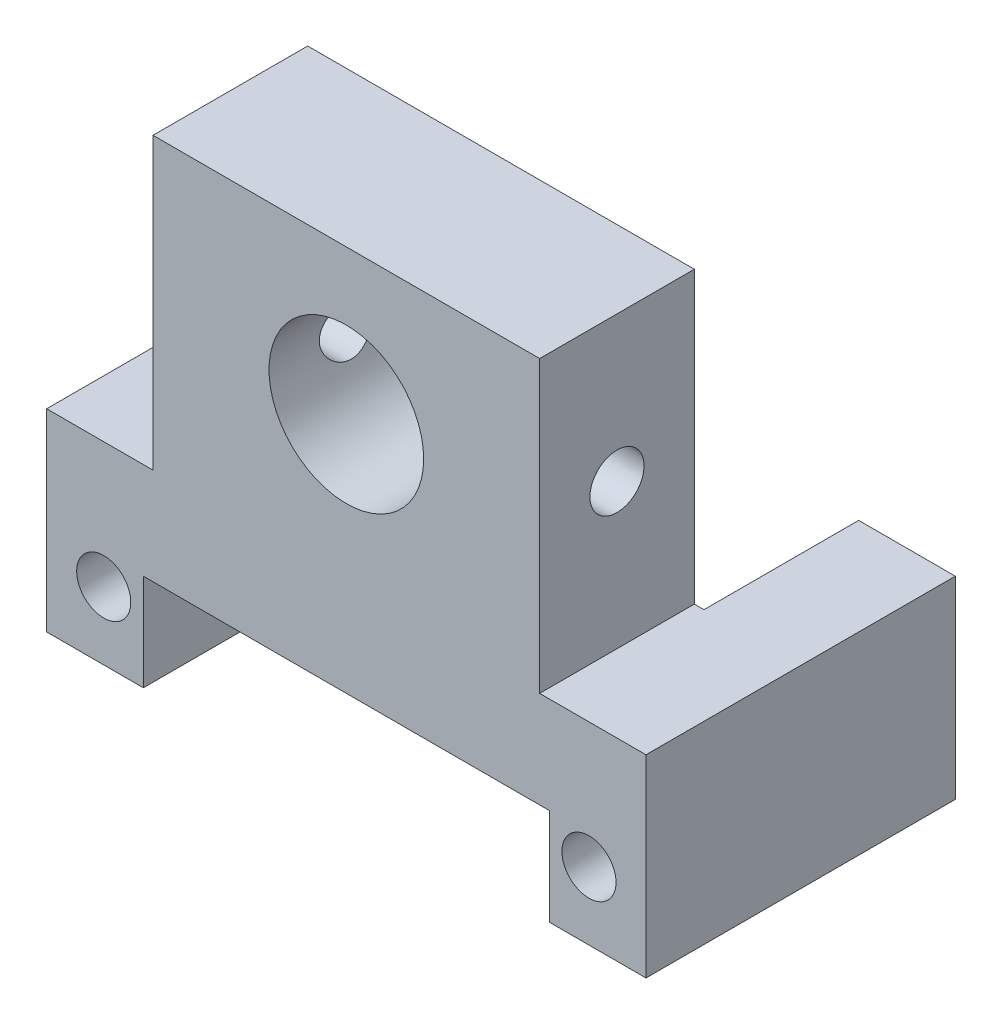
ISO-10303-21;
HEADER;
FILE_DESCRIPTION(('STEP AP214'),'2;1');
FILE_NAME('part.step','',(''),(''),'','','');
FILE_SCHEMA(('AUTOMOTIVE_DESIGN { 1 0 10303 214 1 1 1 1 }'));
ENDSEC;
DATA;
#1=APPLICATION_CONTEXT('core data for automotive mechanical design processes');
#2=APPLICATION_PROTOCOL_DEFINITION('international standard','automotive_design',2000,#1);
#3=PRODUCT_CONTEXT('',#1,'mechanical');
#4=PRODUCT('Part','Part','',(#3));
#5=PRODUCT_RELATED_PRODUCT_CATEGORY('part','',(#4));
#6=PRODUCT_DEFINITION_FORMATION('','',#4);
#7=PRODUCT_DEFINITION_CONTEXT('part definition',#1,'design');
#8=PRODUCT_DEFINITION('design','',#6,#7);
#9=PRODUCT_DEFINITION_SHAPE('','',#8);
#10=(LENGTH_UNIT() NAMED_UNIT(*) SI_UNIT(.MILLI.,.METRE.));
#11=(NAMED_UNIT(*) PLANE_ANGLE_UNIT() SI_UNIT($,.RADIAN.));
#12=(NAMED_UNIT(*) SI_UNIT($,.STERADIAN.) SOLID_ANGLE_UNIT());
#13=UNCERTAINTY_MEASURE_WITH_UNIT(LENGTH_MEASURE(1.E-05),#10,'distance_accuracy_value','');
#14=(GEOMETRIC_REPRESENTATION_CONTEXT(3) GLOBAL_UNCERTAINTY_ASSIGNED_CONTEXT((#13)) GLOBAL_UNIT_ASSIGNED_CONTEXT((#10,
#11,#12)) REPRESENTATION_CONTEXT('',''));
#15=CARTESIAN_POINT('',(0.,0.,0.));
#16=DIRECTION('',(0.,0.,1.));
#17=DIRECTION('',(1.,0.,0.));
#18=AXIS2_PLACEMENT_3D('',#15,#16,#17);
#19=CARTESIAN_POINT('',(0.,0.,0.));
#20=DIRECTION('',(0.,0.,-1.));
#21=DIRECTION('',(-1.,0.,0.));
#22=AXIS2_PLACEMENT_3D('',#19,#20,#21);
#23=PLANE('',#22);
#24=DIRECTION('',(-1.,0.,0.));
#25=VECTOR('',#24,1.);
#26=CARTESIAN_POINT('',(15.5,10.,0.));
#27=LINE('',#26,#25);
#28=CARTESIAN_POINT('',(-10.5,10.,0.));
#29=VERTEX_POINT('',#28);
#30=CARTESIAN_POINT('',(-15.5,10.,0.));
#31=VERTEX_POINT('',#30);
#32=EDGE_CURVE('E201',#29,#31,#27,.T.);
#33=ORIENTED_EDGE('',*,*,#32,.F.);
#34=DIRECTION('',(0.,1.,0.));
#35=VECTOR('',#34,1.);
#36=CARTESIAN_POINT('',(-10.5,0.,0.));
#37=LINE('',#36,#35);
#38=CARTESIAN_POINT('',(-10.5,0.,0.));
#39=VERTEX_POINT('',#38);
#40=EDGE_CURVE('E174',#39,#29,#37,.T.);
#41=ORIENTED_EDGE('',*,*,#40,.F.);
#42=DIRECTION('',(1.,0.,0.));
#43=VECTOR('',#42,1.);
#44=CARTESIAN_POINT('',(-10.5,0.,0.));
#45=LINE('',#44,#43);
#46=CARTESIAN_POINT('',(-15.5,0.,0.));
#47=VERTEX_POINT('',#46);
#48=EDGE_CURVE('E176',#47,#39,#45,.T.);
#49=ORIENTED_EDGE('',*,*,#48,.F.);
#50=DIRECTION('',(0.,-1.,0.));
#51=VECTOR('',#50,1.);
#52=CARTESIAN_POINT('',(-15.5,0.,0.));
#53=LINE('',#52,#51);
#54=EDGE_CURVE('E200',#31,#47,#53,.T.);
#55=ORIENTED_EDGE('',*,*,#54,.F.);
#56=EDGE_LOOP('',(#33,#41,#49,#55));
#57=FACE_BOUND('',#56,.T.);
#58=CARTESIAN_POINT('',(-12.55,3.5,0.));
#59=DIRECTION('',(0.,0.,1.));
#60=DIRECTION('',(-1.,0.,0.));
#61=AXIS2_PLACEMENT_3D('',#58,#59,#60);
#62=CIRCLE('',#61,1.4);
#63=CARTESIAN_POINT('',(-13.95,3.5,0.));
#64=VERTEX_POINT('',#63);
#65=EDGE_CURVE('E272',#64,#64,#62,.T.);
#66=ORIENTED_EDGE('',*,*,#65,.T.);
#67=EDGE_LOOP('',(#66));
#68=FACE_BOUND('',#67,.T.);
#69=ADVANCED_FACE('F33',(#57,#68),#23,.T.);
#70=CARTESIAN_POINT('',(15.5,10.,16.));
#71=DIRECTION('',(0.,-1.,0.));
#72=DIRECTION('',(0.,0.,-1.));
#73=AXIS2_PLACEMENT_3D('',#70,#71,#72);
#74=PLANE('',#73);
#75=DIRECTION('',(-1.,0.,0.));
#76=VECTOR('',#75,1.);
#77=CARTESIAN_POINT('',(15.5,10.,8.));
#78=LINE('',#77,#76);
#79=CARTESIAN_POINT('',(-10.,10.,8.));
#80=VERTEX_POINT('',#79);
#81=CARTESIAN_POINT('',(-10.5,10.,8.));
#82=VERTEX_POINT('',#81);
#83=EDGE_CURVE('E310',#80,#82,#78,.T.);
#84=ORIENTED_EDGE('',*,*,#83,.T.);
#85=DIRECTION('',(0.,0.,-1.));
#86=VECTOR('',#85,1.);
#87=CARTESIAN_POINT('',(-10.5,10.,16.));
#88=LINE('',#87,#86);
#89=EDGE_CURVE('E315',#82,#29,#88,.T.);
#90=ORIENTED_EDGE('',*,*,#89,.T.);
#91=ORIENTED_EDGE('',*,*,#32,.T.);
#92=DIRECTION('',(0.,0.,-1.));
#93=VECTOR('',#92,1.);
#94=CARTESIAN_POINT('',(-15.5,10.,16.));
#95=LINE('',#94,#93);
#96=CARTESIAN_POINT('',(-15.5,10.,16.));
#97=VERTEX_POINT('',#96);
#98=EDGE_CURVE('E357',#97,#31,#95,.T.);
#99=ORIENTED_EDGE('',*,*,#98,.F.);
#100=DIRECTION('',(-1.,0.,0.));
#101=VECTOR('',#100,1.);
#102=CARTESIAN_POINT('',(15.5,10.,16.));
#103=LINE('',#102,#101);
#104=CARTESIAN_POINT('',(-10.,10.,16.));
#105=VERTEX_POINT('',#104);
#106=EDGE_CURVE('E185',#105,#97,#103,.T.);
#107=ORIENTED_EDGE('',*,*,#106,.F.);
#108=DIRECTION('',(0.,0.,1.));
#109=VECTOR('',#108,1.);
#110=CARTESIAN_POINT('',(-10.,10.,16.));
#111=LINE('',#110,#109);
#112=EDGE_CURVE('E61',#80,#105,#111,.T.);
#113=ORIENTED_EDGE('',*,*,#112,.F.);
#114=EDGE_LOOP('',(#84,#90,#91,#99,#107,#113));
#115=FACE_BOUND('',#114,.T.);
#116=ADVANCED_FACE('F240',(#115),#74,.F.);
#117=DIRECTION('',(0.,0.,1.));
#118=VECTOR('',#117,1.);
#119=CARTESIAN_POINT('',(10.5,10.,16.));
#120=LINE('',#119,#118);
#121=CARTESIAN_POINT('',(10.5,10.,0.));
#122=VERTEX_POINT('',#121);
#123=CARTESIAN_POINT('',(10.5,10.,8.));
#124=VERTEX_POINT('',#123);
#125=EDGE_CURVE('E313',#122,#124,#120,.T.);
#126=ORIENTED_EDGE('',*,*,#125,.T.);
#127=DIRECTION('',(-1.,0.,0.));
#128=VECTOR('',#127,1.);
#129=CARTESIAN_POINT('',(15.5,10.,8.));
#130=LINE('',#129,#128);
#131=CARTESIAN_POINT('',(10.,10.,8.));
#132=VERTEX_POINT('',#131);
#133=EDGE_CURVE('E147',#124,#132,#130,.T.);
#134=ORIENTED_EDGE('',*,*,#133,.T.);
#135=DIRECTION('',(0.,0.,-1.));
#136=VECTOR('',#135,1.);
#137=CARTESIAN_POINT('',(10.,10.,16.));
#138=LINE('',#137,#136);
#139=CARTESIAN_POINT('',(10.,10.,16.));
#140=VERTEX_POINT('',#139);
#141=EDGE_CURVE('E283',#140,#132,#138,.T.);
#142=ORIENTED_EDGE('',*,*,#141,.F.);
#143=CARTESIAN_POINT('',(15.5,10.,16.));
#144=VERTEX_POINT('',#143);
#145=EDGE_CURVE('E194',#144,#140,#103,.T.);
#146=ORIENTED_EDGE('',*,*,#145,.F.);
#147=DIRECTION('',(0.,0.,-1.));
#148=VECTOR('',#147,1.);
#149=CARTESIAN_POINT('',(15.5,10.,16.));
#150=LINE('',#149,#148);
#151=CARTESIAN_POINT('',(15.5,10.,0.));
#152=VERTEX_POINT('',#151);
#153=EDGE_CURVE('E368',#144,#152,#150,.T.);
#154=ORIENTED_EDGE('',*,*,#153,.T.);
#155=EDGE_CURVE('E197',#152,#122,#27,.T.);
#156=ORIENTED_EDGE('',*,*,#155,.T.);
#157=EDGE_LOOP('',(#126,#134,#142,#146,#154,#156));
#158=FACE_BOUND('',#157,.T.);
#159=ADVANCED_FACE('F247',(#158),#74,.F.);
#160=CARTESIAN_POINT('',(0.,0.,16.));
#161=DIRECTION('',(0.,0.,-1.));
#162=DIRECTION('',(-1.,0.,0.));
#163=AXIS2_PLACEMENT_3D('',#160,#161,#162);
#164=PLANE('',#163);
#165=CARTESIAN_POINT('',(0.,17.5,16.));
#166=DIRECTION('',(0.,0.,1.));
#167=DIRECTION('',(1.,0.,0.));
#168=AXIS2_PLACEMENT_3D('',#165,#166,#167);
#169=CIRCLE('',#168,4.);
#170=CARTESIAN_POINT('',(4.,17.5,16.));
#171=VERTEX_POINT('',#170);
#172=EDGE_CURVE('E318',#171,#171,#169,.T.);
#173=ORIENTED_EDGE('',*,*,#172,.F.);
#174=EDGE_LOOP('',(#173));
#175=FACE_BOUND('',#174,.T.);
#176=CARTESIAN_POINT('',(12.55,3.5,16.));
#177=DIRECTION('',(0.,0.,1.));
#178=DIRECTION('',(1.,0.,0.));
#179=AXIS2_PLACEMENT_3D('',#176,#177,#178);
#180=CIRCLE('',#179,1.4);
#181=CARTESIAN_POINT('',(13.95,3.5,16.));
#182=VERTEX_POINT('',#181);
#183=EDGE_CURVE('E268',#182,#182,#180,.T.);
#184=ORIENTED_EDGE('',*,*,#183,.F.);
#185=EDGE_LOOP('',(#184));
#186=FACE_BOUND('',#185,.T.);
#187=DIRECTION('',(1.,0.,0.));
#188=VECTOR('',#187,1.);
#189=CARTESIAN_POINT('',(10.5,5.,16.));
#190=LINE('',#189,#188);
#191=CARTESIAN_POINT('',(-10.5,5.,16.));
#192=VERTEX_POINT('',#191);
#193=CARTESIAN_POINT('',(10.5,5.,16.));
#194=VERTEX_POINT('',#193);
#195=EDGE_CURVE('E168',#192,#194,#190,.T.);
#196=ORIENTED_EDGE('',*,*,#195,.T.);
#197=DIRECTION('',(0.,-1.,0.));
#198=VECTOR('',#197,1.);
#199=CARTESIAN_POINT('',(10.5,0.,16.));
#200=LINE('',#199,#198);
#201=CARTESIAN_POINT('',(10.5,0.,16.));
#202=VERTEX_POINT('',#201);
#203=EDGE_CURVE('E162',#194,#202,#200,.T.);
#204=ORIENTED_EDGE('',*,*,#203,.T.);
#205=DIRECTION('',(1.,0.,0.));
#206=VECTOR('',#205,1.);
#207=CARTESIAN_POINT('',(10.5,0.,16.));
#208=LINE('',#207,#206);
#209=CARTESIAN_POINT('',(15.5,0.,16.));
#210=VERTEX_POINT('',#209);
#211=EDGE_CURVE('E167',#202,#210,#208,.T.);
#212=ORIENTED_EDGE('',*,*,#211,.T.);
#213=DIRECTION('',(0.,1.,0.));
#214=VECTOR('',#213,1.);
#215=CARTESIAN_POINT('',(15.5,0.,16.));
#216=LINE('',#215,#214);
#217=EDGE_CURVE('E183',#210,#144,#216,.T.);
#218=ORIENTED_EDGE('',*,*,#217,.T.);
#219=ORIENTED_EDGE('',*,*,#145,.T.);
#220=DIRECTION('',(0.,-1.,0.));
#221=VECTOR('',#220,1.);
#222=CARTESIAN_POINT('',(10.,25.,16.));
#223=LINE('',#222,#221);
#224=CARTESIAN_POINT('',(10.,25.,16.));
#225=VERTEX_POINT('',#224);
#226=EDGE_CURVE('E287',#225,#140,#223,.T.);
#227=ORIENTED_EDGE('',*,*,#226,.F.);
#228=DIRECTION('',(1.,0.,0.));
#229=VECTOR('',#228,1.);
#230=CARTESIAN_POINT('',(10.,25.,16.));
#231=LINE('',#230,#229);
#232=CARTESIAN_POINT('',(-10.,25.,16.));
#233=VERTEX_POINT('',#232);
#234=EDGE_CURVE('E322',#233,#225,#231,.T.);
#235=ORIENTED_EDGE('',*,*,#234,.F.);
#236=DIRECTION('',(0.,-1.,0.));
#237=VECTOR('',#236,1.);
#238=CARTESIAN_POINT('',(-10.,25.,16.));
#239=LINE('',#238,#237);
#240=EDGE_CURVE('E277',#233,#105,#239,.T.);
#241=ORIENTED_EDGE('',*,*,#240,.T.);
#242=ORIENTED_EDGE('',*,*,#106,.T.);
#243=DIRECTION('',(0.,-1.,0.));
#244=VECTOR('',#243,1.);
#245=CARTESIAN_POINT('',(-15.5,0.,16.));
#246=LINE('',#245,#244);
#247=CARTESIAN_POINT('',(-15.5,0.,16.));
#248=VERTEX_POINT('',#247);
#249=EDGE_CURVE('E188',#97,#248,#246,.T.);
#250=ORIENTED_EDGE('',*,*,#249,.T.);
#251=DIRECTION('',(1.,0.,0.));
#252=VECTOR('',#251,1.);
#253=CARTESIAN_POINT('',(-10.5,0.,16.));
#254=LINE('',#253,#252);
#255=CARTESIAN_POINT('',(-10.5,0.,16.));
#256=VERTEX_POINT('',#255);
#257=EDGE_CURVE('E343',#248,#256,#254,.T.);
#258=ORIENTED_EDGE('',*,*,#257,.T.);
#259=DIRECTION('',(0.,1.,0.));
#260=VECTOR('',#259,1.);
#261=CARTESIAN_POINT('',(-10.5,0.,16.));
#262=LINE('',#261,#260);
#263=EDGE_CURVE('E173',#256,#192,#262,.T.);
#264=ORIENTED_EDGE('',*,*,#263,.T.);
#265=EDGE_LOOP('',(#196,#204,#212,#218,#219,#227,#235,#241,#242,#250,#258,#264));
#266=FACE_BOUND('',#265,.T.);
#267=CARTESIAN_POINT('',(-12.55,3.5,16.));
#268=DIRECTION('',(0.,0.,1.));
#269=DIRECTION('',(-1.,0.,0.));
#270=AXIS2_PLACEMENT_3D('',#267,#268,#269);
#271=CIRCLE('',#270,1.4);
#272=CARTESIAN_POINT('',(-13.95,3.5,16.));
#273=VERTEX_POINT('',#272);
#274=EDGE_CURVE('E269',#273,#273,#271,.T.);
#275=ORIENTED_EDGE('',*,*,#274,.F.);
#276=EDGE_LOOP('',(#275));
#277=FACE_BOUND('',#276,.T.);
#278=ADVANCED_FACE('F170',(#175,#186,#266,#277),#164,.F.);
#279=DIRECTION('',(0.,-1.,0.));
#280=VECTOR('',#279,1.);
#281=CARTESIAN_POINT('',(10.5,0.,0.));
#282=LINE('',#281,#280);
#283=CARTESIAN_POINT('',(10.5,0.,0.));
#284=VERTEX_POINT('',#283);
#285=EDGE_CURVE('E264',#122,#284,#282,.T.);
#286=ORIENTED_EDGE('',*,*,#285,.F.);
#287=ORIENTED_EDGE('',*,*,#155,.F.);
#288=DIRECTION('',(0.,1.,0.));
#289=VECTOR('',#288,1.);
#290=CARTESIAN_POINT('',(15.5,0.,0.));
#291=LINE('',#290,#289);
#292=CARTESIAN_POINT('',(15.5,0.,0.));
#293=VERTEX_POINT('',#292);
#294=EDGE_CURVE('E206',#293,#152,#291,.T.);
#295=ORIENTED_EDGE('',*,*,#294,.F.);
#296=DIRECTION('',(1.,0.,0.));
#297=VECTOR('',#296,1.);
#298=CARTESIAN_POINT('',(10.5,0.,0.));
#299=LINE('',#298,#297);
#300=EDGE_CURVE('E334',#284,#293,#299,.T.);
#301=ORIENTED_EDGE('',*,*,#300,.F.);
#302=EDGE_LOOP('',(#286,#287,#295,#301));
#303=FACE_BOUND('',#302,.T.);
#304=CARTESIAN_POINT('',(12.55,3.5,0.));
#305=DIRECTION('',(0.,0.,1.));
#306=DIRECTION('',(1.,0.,0.));
#307=AXIS2_PLACEMENT_3D('',#304,#305,#306);
#308=CIRCLE('',#307,1.4);
#309=CARTESIAN_POINT('',(13.95,3.5,0.));
#310=VERTEX_POINT('',#309);
#311=EDGE_CURVE('E179',#310,#310,#308,.T.);
#312=ORIENTED_EDGE('',*,*,#311,.T.);
#313=EDGE_LOOP('',(#312));
#314=FACE_BOUND('',#313,.T.);
#315=ADVANCED_FACE('F243',(#303,#314),#23,.T.);
#316=CARTESIAN_POINT('',(10.5,5.,16.));
#317=DIRECTION('',(0.,1.,0.));
#318=DIRECTION('',(0.,0.,1.));
#319=AXIS2_PLACEMENT_3D('',#316,#317,#318);
#320=PLANE('',#319);
#321=DIRECTION('',(0.,0.,-1.));
#322=VECTOR('',#321,1.);
#323=CARTESIAN_POINT('',(-10.5,5.,16.));
#324=LINE('',#323,#322);
#325=CARTESIAN_POINT('',(-10.5,5.,8.));
#326=VERTEX_POINT('',#325);
#327=EDGE_CURVE('E157',#192,#326,#324,.T.);
#328=ORIENTED_EDGE('',*,*,#327,.T.);
#329=DIRECTION('',(-1.,0.,0.));
#330=VECTOR('',#329,1.);
#331=CARTESIAN_POINT('',(-10.5,5.,8.));
#332=LINE('',#331,#330);
#333=CARTESIAN_POINT('',(10.5,5.,8.));
#334=VERTEX_POINT('',#333);
#335=EDGE_CURVE('E144',#334,#326,#332,.T.);
#336=ORIENTED_EDGE('',*,*,#335,.F.);
#337=DIRECTION('',(0.,0.,-1.));
#338=VECTOR('',#337,1.);
#339=CARTESIAN_POINT('',(10.5,5.,16.));
#340=LINE('',#339,#338);
#341=EDGE_CURVE('E11',#194,#334,#340,.T.);
#342=ORIENTED_EDGE('',*,*,#341,.F.);
#343=ORIENTED_EDGE('',*,*,#195,.F.);
#344=EDGE_LOOP('',(#328,#336,#342,#343));
#345=FACE_BOUND('',#344,.T.);
#346=ADVANCED_FACE('F35',(#345),#320,.F.);
#347=CARTESIAN_POINT('',(10.5,0.,16.));
#348=DIRECTION('',(1.,0.,0.));
#349=DIRECTION('',(0.,0.,-1.));
#350=AXIS2_PLACEMENT_3D('',#347,#348,#349);
#351=PLANE('',#350);
#352=ORIENTED_EDGE('',*,*,#285,.T.);
#353=DIRECTION('',(0.,0.,-1.));
#354=VECTOR('',#353,1.);
#355=CARTESIAN_POINT('',(10.5,0.,16.));
#356=LINE('',#355,#354);
#357=EDGE_CURVE('E46',#202,#284,#356,.T.);
#358=ORIENTED_EDGE('',*,*,#357,.F.);
#359=ORIENTED_EDGE('',*,*,#203,.F.);
#360=ORIENTED_EDGE('',*,*,#341,.T.);
#361=DIRECTION('',(0.,-1.,0.));
#362=VECTOR('',#361,1.);
#363=CARTESIAN_POINT('',(10.5,26.,8.));
#364=LINE('',#363,#362);
#365=EDGE_CURVE('E140',#124,#334,#364,.T.);
#366=ORIENTED_EDGE('',*,*,#365,.F.);
#367=ORIENTED_EDGE('',*,*,#125,.F.);
#368=EDGE_LOOP('',(#352,#358,#359,#360,#366,#367));
#369=FACE_BOUND('',#368,.T.);
#370=ADVANCED_FACE('F160',(#369),#351,.F.);
#371=CARTESIAN_POINT('',(10.5,0.,16.));
#372=DIRECTION('',(0.,1.,0.));
#373=DIRECTION('',(-1.,0.,0.));
#374=AXIS2_PLACEMENT_3D('',#371,#372,#373);
#375=PLANE('',#374);
#376=ORIENTED_EDGE('',*,*,#300,.T.);
#377=DIRECTION('',(0.,0.,-1.));
#378=VECTOR('',#377,1.);
#379=CARTESIAN_POINT('',(15.5,0.,16.));
#380=LINE('',#379,#378);
#381=EDGE_CURVE('E340',#210,#293,#380,.T.);
#382=ORIENTED_EDGE('',*,*,#381,.F.);
#383=ORIENTED_EDGE('',*,*,#211,.F.);
#384=ORIENTED_EDGE('',*,*,#357,.T.);
#385=EDGE_LOOP('',(#376,#382,#383,#384));
#386=FACE_BOUND('',#385,.T.);
#387=ADVANCED_FACE('F337',(#386),#375,.F.);
#388=CARTESIAN_POINT('',(15.5,0.,16.));
#389=DIRECTION('',(-1.,0.,0.));
#390=DIRECTION('',(0.,0.,1.));
#391=AXIS2_PLACEMENT_3D('',#388,#389,#390);
#392=PLANE('',#391);
#393=ORIENTED_EDGE('',*,*,#294,.T.);
#394=ORIENTED_EDGE('',*,*,#153,.F.);
#395=ORIENTED_EDGE('',*,*,#217,.F.);
#396=ORIENTED_EDGE('',*,*,#381,.T.);
#397=EDGE_LOOP('',(#393,#394,#395,#396));
#398=FACE_BOUND('',#397,.T.);
#399=ADVANCED_FACE('F372',(#398),#392,.F.);
#400=CARTESIAN_POINT('',(-15.5,0.,16.));
#401=DIRECTION('',(1.,0.,0.));
#402=DIRECTION('',(0.,0.,-1.));
#403=AXIS2_PLACEMENT_3D('',#400,#401,#402);
#404=PLANE('',#403);
#405=ORIENTED_EDGE('',*,*,#54,.T.);
#406=DIRECTION('',(0.,0.,-1.));
#407=VECTOR('',#406,1.);
#408=CARTESIAN_POINT('',(-15.5,0.,16.));
#409=LINE('',#408,#407);
#410=EDGE_CURVE('E352',#248,#47,#409,.T.);
#411=ORIENTED_EDGE('',*,*,#410,.F.);
#412=ORIENTED_EDGE('',*,*,#249,.F.);
#413=ORIENTED_EDGE('',*,*,#98,.T.);
#414=EDGE_LOOP('',(#405,#411,#412,#413));
#415=FACE_BOUND('',#414,.T.);
#416=ADVANCED_FACE('F353',(#415),#404,.F.);
#417=CARTESIAN_POINT('',(-10.5,0.,16.));
#418=DIRECTION('',(0.,1.,0.));
#419=DIRECTION('',(-1.,0.,0.));
#420=AXIS2_PLACEMENT_3D('',#417,#418,#419);
#421=PLANE('',#420);
#422=ORIENTED_EDGE('',*,*,#48,.T.);
#423=DIRECTION('',(0.,0.,-1.));
#424=VECTOR('',#423,1.);
#425=CARTESIAN_POINT('',(-10.5,0.,16.));
#426=LINE('',#425,#424);
#427=EDGE_CURVE('E358',#256,#39,#426,.T.);
#428=ORIENTED_EDGE('',*,*,#427,.F.);
#429=ORIENTED_EDGE('',*,*,#257,.F.);
#430=ORIENTED_EDGE('',*,*,#410,.T.);
#431=EDGE_LOOP('',(#422,#428,#429,#430));
#432=FACE_BOUND('',#431,.T.);
#433=ADVANCED_FACE('F360',(#432),#421,.F.);
#434=CARTESIAN_POINT('',(-10.5,0.,16.));
#435=DIRECTION('',(-1.,0.,0.));
#436=DIRECTION('',(0.,-1.,0.));
#437=AXIS2_PLACEMENT_3D('',#434,#435,#436);
#438=PLANE('',#437);
#439=ORIENTED_EDGE('',*,*,#40,.T.);
#440=ORIENTED_EDGE('',*,*,#89,.F.);
#441=DIRECTION('',(0.,-1.,0.));
#442=VECTOR('',#441,1.);
#443=CARTESIAN_POINT('',(-10.5,26.,8.));
#444=LINE('',#443,#442);
#445=EDGE_CURVE('E151',#82,#326,#444,.T.);
#446=ORIENTED_EDGE('',*,*,#445,.T.);
#447=ORIENTED_EDGE('',*,*,#327,.F.);
#448=ORIENTED_EDGE('',*,*,#263,.F.);
#449=ORIENTED_EDGE('',*,*,#427,.T.);
#450=EDGE_LOOP('',(#439,#440,#446,#447,#448,#449));
#451=FACE_BOUND('',#450,.T.);
#452=ADVANCED_FACE('F364',(#451),#438,.F.);
#453=CARTESIAN_POINT('',(12.55,3.5,16.));
#454=DIRECTION('',(0.,0.,-1.));
#455=DIRECTION('',(-1.,0.,0.));
#456=AXIS2_PLACEMENT_3D('',#453,#454,#455);
#457=CYLINDRICAL_SURFACE('',#456,1.4);
#458=ORIENTED_EDGE('',*,*,#183,.T.);
#459=EDGE_LOOP('',(#458));
#460=FACE_BOUND('',#459,.T.);
#461=ORIENTED_EDGE('',*,*,#311,.F.);
#462=EDGE_LOOP('',(#461));
#463=FACE_BOUND('',#462,.T.);
#464=ADVANCED_FACE('F385',(#460,#463),#457,.F.);
#465=CARTESIAN_POINT('',(-12.55,3.5,16.));
#466=DIRECTION('',(0.,0.,-1.));
#467=DIRECTION('',(-1.,0.,0.));
#468=AXIS2_PLACEMENT_3D('',#465,#466,#467);
#469=CYLINDRICAL_SURFACE('',#468,1.4);
#470=ORIENTED_EDGE('',*,*,#274,.T.);
#471=EDGE_LOOP('',(#470));
#472=FACE_BOUND('',#471,.T.);
#473=ORIENTED_EDGE('',*,*,#65,.F.);
#474=EDGE_LOOP('',(#473));
#475=FACE_BOUND('',#474,.T.);
#476=ADVANCED_FACE('F376',(#472,#475),#469,.F.);
#477=CARTESIAN_POINT('',(-10.,25.,16.));
#478=DIRECTION('',(1.,0.,0.));
#479=DIRECTION('',(0.,0.,-1.));
#480=AXIS2_PLACEMENT_3D('',#477,#478,#479);
#481=PLANE('',#480);
#482=CARTESIAN_POINT('',(-10.,17.5,12.));
#483=DIRECTION('',(-1.,0.,0.));
#484=DIRECTION('',(0.,0.,1.));
#485=AXIS2_PLACEMENT_3D('',#482,#483,#484);
#486=CIRCLE('',#485,1.4);
#487=CARTESIAN_POINT('',(-10.,17.5,13.4));
#488=VERTEX_POINT('',#487);
#489=EDGE_CURVE('E218',#488,#488,#486,.T.);
#490=ORIENTED_EDGE('',*,*,#489,.F.);
#491=EDGE_LOOP('',(#490));
#492=FACE_BOUND('',#491,.T.);
#493=DIRECTION('',(0.,0.,1.));
#494=VECTOR('',#493,1.);
#495=CARTESIAN_POINT('',(-10.,25.,16.));
#496=LINE('',#495,#494);
#497=CARTESIAN_POINT('',(-10.,25.,8.));
#498=VERTEX_POINT('',#497);
#499=EDGE_CURVE('E286',#498,#233,#496,.T.);
#500=ORIENTED_EDGE('',*,*,#499,.F.);
#501=DIRECTION('',(0.,-1.,0.));
#502=VECTOR('',#501,1.);
#503=CARTESIAN_POINT('',(-10.,25.,8.));
#504=LINE('',#503,#502);
#505=EDGE_CURVE('E54',#498,#80,#504,.T.);
#506=ORIENTED_EDGE('',*,*,#505,.T.);
#507=ORIENTED_EDGE('',*,*,#112,.T.);
#508=ORIENTED_EDGE('',*,*,#240,.F.);
#509=EDGE_LOOP('',(#500,#506,#507,#508));
#510=FACE_BOUND('',#509,.T.);
#511=ADVANCED_FACE('F374',(#492,#510),#481,.F.);
#512=CARTESIAN_POINT('',(10.,25.,16.));
#513=DIRECTION('',(-1.,0.,0.));
#514=DIRECTION('',(0.,0.,1.));
#515=AXIS2_PLACEMENT_3D('',#512,#513,#514);
#516=PLANE('',#515);
#517=CARTESIAN_POINT('',(10.,17.5,12.));
#518=DIRECTION('',(-1.,0.,0.));
#519=DIRECTION('',(0.,0.,1.));
#520=AXIS2_PLACEMENT_3D('',#517,#518,#519);
#521=CIRCLE('',#520,1.4);
#522=CARTESIAN_POINT('',(10.,17.5,13.4));
#523=VERTEX_POINT('',#522);
#524=EDGE_CURVE('E158',#523,#523,#521,.T.);
#525=ORIENTED_EDGE('',*,*,#524,.T.);
#526=EDGE_LOOP('',(#525));
#527=FACE_BOUND('',#526,.T.);
#528=ORIENTED_EDGE('',*,*,#141,.T.);
#529=DIRECTION('',(0.,1.,0.));
#530=VECTOR('',#529,1.);
#531=CARTESIAN_POINT('',(10.,25.,8.));
#532=LINE('',#531,#530);
#533=CARTESIAN_POINT('',(10.,25.,8.));
#534=VERTEX_POINT('',#533);
#535=EDGE_CURVE('E300',#132,#534,#532,.T.);
#536=ORIENTED_EDGE('',*,*,#535,.T.);
#537=DIRECTION('',(0.,0.,-1.));
#538=VECTOR('',#537,1.);
#539=CARTESIAN_POINT('',(10.,25.,16.));
#540=LINE('',#539,#538);
#541=EDGE_CURVE('E290',#225,#534,#540,.T.);
#542=ORIENTED_EDGE('',*,*,#541,.F.);
#543=ORIENTED_EDGE('',*,*,#226,.T.);
#544=EDGE_LOOP('',(#528,#536,#542,#543));
#545=FACE_BOUND('',#544,.T.);
#546=ADVANCED_FACE('F330',(#527,#545),#516,.F.);
#547=CARTESIAN_POINT('',(0.,25.,0.));
#548=DIRECTION('',(0.,1.,0.));
#549=DIRECTION('',(0.,0.,1.));
#550=AXIS2_PLACEMENT_3D('',#547,#548,#549);
#551=PLANE('',#550);
#552=DIRECTION('',(1.,0.,0.));
#553=VECTOR('',#552,1.);
#554=CARTESIAN_POINT('',(0.,25.,8.));
#555=LINE('',#554,#553);
#556=EDGE_CURVE('E298',#498,#534,#555,.T.);
#557=ORIENTED_EDGE('',*,*,#556,.F.);
#558=ORIENTED_EDGE('',*,*,#499,.T.);
#559=ORIENTED_EDGE('',*,*,#234,.T.);
#560=ORIENTED_EDGE('',*,*,#541,.T.);
#561=EDGE_LOOP('',(#557,#558,#559,#560));
#562=FACE_BOUND('',#561,.T.);
#563=ADVANCED_FACE('F236',(#562),#551,.T.);
#564=CARTESIAN_POINT('',(0.,17.5,1.));
#565=DIRECTION('',(0.,0.,1.));
#566=DIRECTION('',(1.,0.,0.));
#567=AXIS2_PLACEMENT_3D('',#564,#565,#566);
#568=CYLINDRICAL_SURFACE('',#567,4.);
#569=CARTESIAN_POINT('',(4.,17.5,10.6));
#570=CARTESIAN_POINT('',(4.00000082986481,17.5761677462671,10.5999988173402));
#571=CARTESIAN_POINT('',(3.99780479114858,17.6523270486423,10.6062358685621));
#572=CARTESIAN_POINT('',(3.98926181700077,17.8023893436676,10.6309335172649));
#573=CARTESIAN_POINT('',(3.9829148630442,17.8762923262464,10.6493941692981));
#574=CARTESIAN_POINT('',(3.96675650768946,18.0196569424064,10.6978195754008));
#575=CARTESIAN_POINT('',(3.95695125145594,18.0891261975032,10.7277639319089));
#576=CARTESIAN_POINT('',(3.9348675989258,18.2220546581179,10.7982100445056));
#577=CARTESIAN_POINT('',(3.92258864059177,18.2855124929853,10.8387142004493));
#578=CARTESIAN_POINT('',(3.89632246944127,18.4070103568213,10.9307314062603));
#579=CARTESIAN_POINT('',(3.88229136710821,18.4647927859042,10.982571967289));
#580=CARTESIAN_POINT('',(3.85433357977589,18.571044740605,11.095094667579));
#581=CARTESIAN_POINT('',(3.84040692188788,18.619511923492,11.1557790242748));
#582=CARTESIAN_POINT('',(3.81374141685311,18.7072918257443,11.2866618598235));
#583=CARTESIAN_POINT('',(3.80105542448103,18.7462585322465,11.3571042233837));
#584=CARTESIAN_POINT('',(3.7789809773823,18.8116797291381,11.5040578361165));
#585=CARTESIAN_POINT('',(3.76959139787598,18.8381384884745,11.5805670042704));
#586=CARTESIAN_POINT('',(3.75563774541798,18.8768065573103,11.7345372130727));
#587=CARTESIAN_POINT('',(3.75090953094941,18.8895022686182,11.8118607588545));
#588=CARTESIAN_POINT('',(3.74633028750751,18.9018047910955,11.9676740475679));
#589=CARTESIAN_POINT('',(3.74647756372738,18.9014161506162,12.0461633757696));
#590=CARTESIAN_POINT('',(3.75148970736213,18.8879363996028,12.197819783553));
#591=CARTESIAN_POINT('',(3.75611332175072,18.8754948604099,12.2710539921123));
#592=CARTESIAN_POINT('',(3.76916001820362,18.8393276332493,12.4143209625164));
#593=CARTESIAN_POINT('',(3.77758359931588,18.8156004631224,12.4843533025304));
#594=CARTESIAN_POINT('',(3.79744244284543,18.7571374843694,12.6206449467115));
#595=CARTESIAN_POINT('',(3.80892719702265,18.7222186617855,12.6868182205394));
#596=CARTESIAN_POINT('',(3.83359525154267,18.6424907540121,12.812564779594));
#597=CARTESIAN_POINT('',(3.84677908105135,18.5976785844908,12.8721359978576));
#598=CARTESIAN_POINT('',(3.87429296524979,18.4963735980745,12.9866172913478));
#599=CARTESIAN_POINT('',(3.88864517297683,18.4393544313683,13.0410572998195));
#600=CARTESIAN_POINT('',(3.91621496321696,18.3168227389022,13.1397319487556));
#601=CARTESIAN_POINT('',(3.9294324133194,18.2513092242013,13.1839653992682));
#602=CARTESIAN_POINT('',(3.95344925346483,18.1125738916474,13.2614023965016));
#603=CARTESIAN_POINT('',(3.96421795197823,18.0392695213642,13.2944682249781));
#604=CARTESIAN_POINT('',(3.98189952941453,17.8876700571897,13.3476489227466));
#605=CARTESIAN_POINT('',(3.98881389118768,17.8093768955348,13.3677687731086));
#606=CARTESIAN_POINT('',(3.99775624065143,17.6539928174726,13.3936263253687));
#607=CARTESIAN_POINT('',(3.99999955666171,17.5770197194508,13.3999983226076));
#608=CARTESIAN_POINT('',(4.00000044278596,17.4230814054246,13.4000016757368));
#609=CARTESIAN_POINT('',(3.99775885923408,17.3461161906735,13.3936354354281));
#610=CARTESIAN_POINT('',(3.98918412928159,17.1969950821146,13.3688378600385));
#611=CARTESIAN_POINT('',(3.98298652329724,17.1247641890404,13.3508059449066));
#612=CARTESIAN_POINT('',(3.96725836043701,16.9843899823293,13.3036984740398));
#613=CARTESIAN_POINT('',(3.95772737231119,16.9162471989205,13.2746214893283));
#614=CARTESIAN_POINT('',(3.93596170115072,16.7838772821576,13.2053639645474));
#615=CARTESIAN_POINT('',(3.92365949372611,16.7198107034902,13.1648984061186));
#616=CARTESIAN_POINT('',(3.89773406986807,16.5991768849665,13.0743419281707));
#617=CARTESIAN_POINT('',(3.88411041556164,16.5426121457096,13.0242478127104));
#618=CARTESIAN_POINT('',(3.85620335889683,16.4356187384784,12.9128799193544));
#619=CARTESIAN_POINT('',(3.84192126232498,16.3856421953528,12.8511703568093));
#620=CARTESIAN_POINT('',(3.81499671476278,16.2966850294971,12.7199416402401));
#621=CARTESIAN_POINT('',(3.80235432130955,16.2577047925707,12.6504222123276));
#622=CARTESIAN_POINT('',(3.78024221979789,16.191956074083,12.505333083917));
#623=CARTESIAN_POINT('',(3.77077257631505,16.1651878410711,12.4297632603127));
#624=CARTESIAN_POINT('',(3.756270168259,16.1248993352502,12.2747738184455));
#625=CARTESIAN_POINT('',(3.75123512721405,16.1113722647864,12.1953561975387));
#626=CARTESIAN_POINT('',(3.74644824414629,16.0985122428172,12.0397518713831));
#627=CARTESIAN_POINT('',(3.74641418720457,16.098421076877,11.9636358813258));
#628=CARTESIAN_POINT('',(3.75092530733651,16.1105395999086,11.812534950737));
#629=CARTESIAN_POINT('',(3.75547015540141,16.1227484050886,11.7375499293346));
#630=CARTESIAN_POINT('',(3.76840677603561,16.1585613874461,11.5925796165029));
#631=CARTESIAN_POINT('',(3.77670717816819,16.1818955771116,11.5225188133278));
#632=CARTESIAN_POINT('',(3.79617795864866,16.2390715216854,11.3872567620772));
#633=CARTESIAN_POINT('',(3.80734901226808,16.2729157492909,11.3220566620607));
#634=CARTESIAN_POINT('',(3.83195950276457,16.3520119172056,11.1950261698431));
#635=CARTESIAN_POINT('',(3.84548113997338,16.3977270371052,11.1335002399194));
#636=CARTESIAN_POINT('',(3.87295024586658,16.4985103954637,11.0187489485266));
#637=CARTESIAN_POINT('',(3.88689783972523,16.5535814054238,10.9655260556592));
#638=CARTESIAN_POINT('',(3.91439467810872,16.6744587339853,10.8664864873144));
#639=CARTESIAN_POINT('',(3.92789838227884,16.7406344085487,10.8211062197962));
#640=CARTESIAN_POINT('',(3.95231210468628,16.8801329483667,10.7421506018882));
#641=CARTESIAN_POINT('',(3.96322246637471,16.953454865388,10.7085736880305));
#642=CARTESIAN_POINT('',(3.98110512406599,17.1043880649094,10.6546971123835));
#643=CARTESIAN_POINT('',(3.98811886032264,17.1819441814987,10.634257356572));
#644=CARTESIAN_POINT('',(3.99756505486416,17.3396706033579,10.6069118059979));
#645=CARTESIAN_POINT('',(3.99999912663844,17.419839977804,10.600001244648));
#646=CARTESIAN_POINT('',(4.,17.5,10.6));
#647=B_SPLINE_CURVE_WITH_KNOTS('',3,(#569,#570,#571,#572,#573,#574,#575,#576,#577,#578,#579,
#580,#581,#582,#583,#584,#585,#586,#587,#588,#589,#590,#591,#592,#593,#594,#595,#596,#597,#598,
#599,#600,#601,#602,#603,#604,#605,#606,#607,#608,#609,#610,#611,#612,#613,#614,#615,#616,#617,
#618,#619,#620,#621,#622,#623,#624,#625,#626,#627,#628,#629,#630,#631,#632,#633,#634,#635,#636,
#637,#638,#639,#640,#641,#642,#643,#644,#645,#646),.UNSPECIFIED.,.T.,.F.,(4,2,2,2,2,2,2,2,2,2,2,
2,2,2,2,2,2,2,2,2,2,2,2,2,2,2,2,2,2,2,2,2,2,2,2,2,2,2,4),(0.,0.228207977612566,
0.456416973694619,0.684222484352805,0.912079812048506,1.14768516041179,1.38334968485675,
1.62662153792174,1.86981030255115,2.10409213566523,2.33829252912541,2.56053520214027,
2.78280707068728,3.00891695199439,3.23509742469696,3.47438312550876,3.71369670983951,
3.95586205695962,4.19793417319747,4.4285750217208,4.65917235069278,4.88226454841274,
5.10538561894156,5.33468151083444,5.56405364319219,5.80497030253308,6.04589541334731,
6.28682542745981,6.5276316896484,6.75484326316778,6.98203851198392,7.20398099743383,
7.42597573891606,7.65845228355459,7.89099781533053,8.13391912161406,8.37680823849799,
8.617062229206,8.85723155870923),.UNSPECIFIED.);
#648=CARTESIAN_POINT('',(4.,17.5,10.6));
#649=VERTEX_POINT('',#648);
#650=EDGE_CURVE('E37',#649,#649,#647,.T.);
#651=ORIENTED_EDGE('',*,*,#650,.T.);
#652=EDGE_LOOP('',(#651));
#653=FACE_BOUND('',#652,.T.);
#654=CARTESIAN_POINT('',(-4.,17.5,13.4));
#655=CARTESIAN_POINT('',(-4.00000082986481,17.5761677462671,13.4000011826598));
#656=CARTESIAN_POINT('',(-3.99780479114858,17.6523270486423,13.3937641314379));
#657=CARTESIAN_POINT('',(-3.98926181700077,17.8023893436676,13.3690664827351));
#658=CARTESIAN_POINT('',(-3.9829148630442,17.8762923262464,13.3506058307019));
#659=CARTESIAN_POINT('',(-3.96675650768946,18.0196569424064,13.3021804245992));
#660=CARTESIAN_POINT('',(-3.95695125145594,18.0891261975032,13.2722360680911));
#661=CARTESIAN_POINT('',(-3.9348675989258,18.2220546581179,13.2017899554944));
#662=CARTESIAN_POINT('',(-3.92258864059177,18.2855124929853,13.1612857995507));
#663=CARTESIAN_POINT('',(-3.89632246944127,18.4070103568213,13.0692685937397));
#664=CARTESIAN_POINT('',(-3.88229136710821,18.4647927859042,13.017428032711));
#665=CARTESIAN_POINT('',(-3.85433357977589,18.571044740605,12.904905332421));
#666=CARTESIAN_POINT('',(-3.84040692188788,18.619511923492,12.8442209757252));
#667=CARTESIAN_POINT('',(-3.81374141685311,18.7072918257443,12.7133381401765));
#668=CARTESIAN_POINT('',(-3.80105542448103,18.7462585322465,12.6428957766163));
#669=CARTESIAN_POINT('',(-3.7789809773823,18.8116797291381,12.4959421638835));
#670=CARTESIAN_POINT('',(-3.76959139787598,18.8381384884745,12.4194329957296));
#671=CARTESIAN_POINT('',(-3.75563774541798,18.8768065573103,12.2654627869273));
#672=CARTESIAN_POINT('',(-3.75090953094941,18.8895022686182,12.1881392411455));
#673=CARTESIAN_POINT('',(-3.74633028750751,18.9018047910955,12.0323259524321));
#674=CARTESIAN_POINT('',(-3.74647756372738,18.9014161506162,11.9538366242304));
#675=CARTESIAN_POINT('',(-3.75148970736213,18.8879363996028,11.802180216447));
#676=CARTESIAN_POINT('',(-3.75611332175072,18.8754948604099,11.7289460078877));
#677=CARTESIAN_POINT('',(-3.76916001820362,18.8393276332493,11.5856790374836));
#678=CARTESIAN_POINT('',(-3.77758359931588,18.8156004631224,11.5156466974696));
#679=CARTESIAN_POINT('',(-3.79744244284543,18.7571374843694,11.3793550532885));
#680=CARTESIAN_POINT('',(-3.80892719702265,18.7222186617855,11.3131817794606));
#681=CARTESIAN_POINT('',(-3.83359525154267,18.6424907540121,11.187435220406));
#682=CARTESIAN_POINT('',(-3.84677908105135,18.5976785844908,11.1278640021424));
#683=CARTESIAN_POINT('',(-3.87429296524979,18.4963735980745,11.0133827086522));
#684=CARTESIAN_POINT('',(-3.88864517297683,18.4393544313683,10.9589427001805));
#685=CARTESIAN_POINT('',(-3.91621496321696,18.3168227389022,10.8602680512444));
#686=CARTESIAN_POINT('',(-3.9294324133194,18.2513092242013,10.8160346007318));
#687=CARTESIAN_POINT('',(-3.95344925346483,18.1125738916474,10.7385976034984));
#688=CARTESIAN_POINT('',(-3.96421795197823,18.0392695213642,10.7055317750219));
#689=CARTESIAN_POINT('',(-3.98189952941453,17.8876700571897,10.6523510772534));
#690=CARTESIAN_POINT('',(-3.98881389118768,17.8093768955348,10.6322312268914));
#691=CARTESIAN_POINT('',(-3.99775624065143,17.6539928174726,10.6063736746313));
#692=CARTESIAN_POINT('',(-3.99999955666171,17.5770197194508,10.6000016773924));
#693=CARTESIAN_POINT('',(-4.00000044278596,17.4230814054246,10.5999983242632));
#694=CARTESIAN_POINT('',(-3.99775885923408,17.3461161906735,10.6063645645719));
#695=CARTESIAN_POINT('',(-3.98918412928159,17.1969950821146,10.6311621399615));
#696=CARTESIAN_POINT('',(-3.98298652329724,17.1247641890404,10.6491940550934));
#697=CARTESIAN_POINT('',(-3.96725836043701,16.9843899823293,10.6963015259602));
#698=CARTESIAN_POINT('',(-3.95772737231119,16.9162471989205,10.7253785106717));
#699=CARTESIAN_POINT('',(-3.93596170115072,16.7838772821576,10.7946360354526));
#700=CARTESIAN_POINT('',(-3.92365949372611,16.7198107034902,10.8351015938814));
#701=CARTESIAN_POINT('',(-3.89773406986807,16.5991768849665,10.9256580718293));
#702=CARTESIAN_POINT('',(-3.88411041556164,16.5426121457096,10.9757521872896));
#703=CARTESIAN_POINT('',(-3.85620335889683,16.4356187384784,11.0871200806456));
#704=CARTESIAN_POINT('',(-3.84192126232498,16.3856421953528,11.1488296431907));
#705=CARTESIAN_POINT('',(-3.81499671476278,16.2966850294971,11.2800583597599));
#706=CARTESIAN_POINT('',(-3.80235432130955,16.2577047925707,11.3495777876724));
#707=CARTESIAN_POINT('',(-3.78024221979789,16.191956074083,11.494666916083));
#708=CARTESIAN_POINT('',(-3.77077257631505,16.1651878410711,11.5702367396873));
#709=CARTESIAN_POINT('',(-3.756270168259,16.1248993352502,11.7252261815545));
#710=CARTESIAN_POINT('',(-3.75123512721405,16.1113722647864,11.8046438024613));
#711=CARTESIAN_POINT('',(-3.74644824414629,16.0985122428172,11.9602481286169));
#712=CARTESIAN_POINT('',(-3.74641418720457,16.098421076877,12.0363641186741));
#713=CARTESIAN_POINT('',(-3.75092530733651,16.1105395999086,12.187465049263));
#714=CARTESIAN_POINT('',(-3.75547015540141,16.1227484050886,12.2624500706654));
#715=CARTESIAN_POINT('',(-3.76840677603561,16.1585613874461,12.4074203834971));
#716=CARTESIAN_POINT('',(-3.77670717816819,16.1818955771116,12.4774811866722));
#717=CARTESIAN_POINT('',(-3.79617795864866,16.2390715216854,12.6127432379228));
#718=CARTESIAN_POINT('',(-3.80734901226808,16.2729157492909,12.6779433379393));
#719=CARTESIAN_POINT('',(-3.83195950276457,16.3520119172056,12.8049738301569));
#720=CARTESIAN_POINT('',(-3.84548113997338,16.3977270371052,12.8664997600806));
#721=CARTESIAN_POINT('',(-3.87295024586658,16.4985103954637,12.9812510514734));
#722=CARTESIAN_POINT('',(-3.88689783972523,16.5535814054238,13.0344739443408));
#723=CARTESIAN_POINT('',(-3.91439467810872,16.6744587339853,13.1335135126856));
#724=CARTESIAN_POINT('',(-3.92789838227884,16.7406344085487,13.1788937802038));
#725=CARTESIAN_POINT('',(-3.95231210468628,16.8801329483667,13.2578493981118));
#726=CARTESIAN_POINT('',(-3.96322246637471,16.953454865388,13.2914263119695));
#727=CARTESIAN_POINT('',(-3.98110512406599,17.1043880649094,13.3453028876165));
#728=CARTESIAN_POINT('',(-3.98811886032264,17.1819441814987,13.365742643428));
#729=CARTESIAN_POINT('',(-3.99756505486416,17.3396706033579,13.3930881940021));
#730=CARTESIAN_POINT('',(-3.99999912663844,17.419839977804,13.399998755352));
#731=CARTESIAN_POINT('',(-4.,17.5,13.4));
#732=B_SPLINE_CURVE_WITH_KNOTS('',3,(#654,#655,#656,#657,#658,#659,#660,#661,#662,#663,#664,
#665,#666,#667,#668,#669,#670,#671,#672,#673,#674,#675,#676,#677,#678,#679,#680,#681,#682,#683,
#684,#685,#686,#687,#688,#689,#690,#691,#692,#693,#694,#695,#696,#697,#698,#699,#700,#701,#702,
#703,#704,#705,#706,#707,#708,#709,#710,#711,#712,#713,#714,#715,#716,#717,#718,#719,#720,#721,
#722,#723,#724,#725,#726,#727,#728,#729,#730,#731),.UNSPECIFIED.,.T.,.F.,(4,2,2,2,2,2,2,2,2,2,2,
2,2,2,2,2,2,2,2,2,2,2,2,2,2,2,2,2,2,2,2,2,2,2,2,2,2,2,4),(0.,0.228207977612566,
0.456416973694619,0.684222484352805,0.912079812048506,1.14768516041179,1.38334968485675,
1.62662153792174,1.86981030255115,2.10409213566523,2.33829252912541,2.56053520214027,
2.78280707068728,3.00891695199439,3.23509742469696,3.47438312550876,3.71369670983951,
3.95586205695962,4.19793417319747,4.4285750217208,4.65917235069278,4.88226454841274,
5.10538561894156,5.33468151083444,5.56405364319219,5.80497030253308,6.04589541334732,
6.28682542745981,6.52763168964841,6.75484326316778,6.98203851198392,7.20398099743383,
7.42597573891607,7.65845228355459,7.89099781533053,8.13391912161406,8.37680823849799,
8.617062229206,8.85723155870924),.UNSPECIFIED.);
#733=CARTESIAN_POINT('',(-4.,17.5,13.4));
#734=VERTEX_POINT('',#733);
#735=EDGE_CURVE('E214',#734,#734,#732,.T.);
#736=ORIENTED_EDGE('',*,*,#735,.T.);
#737=EDGE_LOOP('',(#736));
#738=FACE_BOUND('',#737,.T.);
#739=CARTESIAN_POINT('',(0.,17.5,8.));
#740=DIRECTION('',(0.,0.,1.));
#741=DIRECTION('',(1.,0.,0.));
#742=AXIS2_PLACEMENT_3D('',#739,#740,#741);
#743=CIRCLE('',#742,4.);
#744=CARTESIAN_POINT('',(4.,17.5,8.));
#745=VERTEX_POINT('',#744);
#746=EDGE_CURVE('E296',#745,#745,#743,.F.);
#747=ORIENTED_EDGE('',*,*,#746,.T.);
#748=EDGE_LOOP('',(#747));
#749=FACE_BOUND('',#748,.T.);
#750=ORIENTED_EDGE('',*,*,#172,.T.);
#751=EDGE_LOOP('',(#750));
#752=FACE_BOUND('',#751,.T.);
#753=ADVANCED_FACE('F219',(#653,#738,#749,#752),#568,.F.);
#754=CARTESIAN_POINT('',(-10.5,26.,8.));
#755=DIRECTION('',(0.,0.,1.));
#756=DIRECTION('',(1.,0.,0.));
#757=AXIS2_PLACEMENT_3D('',#754,#755,#756);
#758=PLANE('',#757);
#759=ORIENTED_EDGE('',*,*,#746,.F.);
#760=EDGE_LOOP('',(#759));
#761=FACE_BOUND('',#760,.T.);
#762=ORIENTED_EDGE('',*,*,#505,.F.);
#763=ORIENTED_EDGE('',*,*,#556,.T.);
#764=ORIENTED_EDGE('',*,*,#535,.F.);
#765=ORIENTED_EDGE('',*,*,#133,.F.);
#766=ORIENTED_EDGE('',*,*,#365,.T.);
#767=ORIENTED_EDGE('',*,*,#335,.T.);
#768=ORIENTED_EDGE('',*,*,#445,.F.);
#769=ORIENTED_EDGE('',*,*,#83,.F.);
#770=EDGE_LOOP('',(#762,#763,#764,#765,#766,#767,#768,#769));
#771=FACE_BOUND('',#770,.T.);
#772=ADVANCED_FACE('F142',(#761,#771),#758,.F.);
#773=CARTESIAN_POINT('',(11.,17.5,12.));
#774=DIRECTION('',(-1.,0.,0.));
#775=DIRECTION('',(0.,0.,1.));
#776=AXIS2_PLACEMENT_3D('',#773,#774,#775);
#777=CYLINDRICAL_SURFACE('',#776,1.4);
#778=ORIENTED_EDGE('',*,*,#489,.T.);
#779=EDGE_LOOP('',(#778));
#780=FACE_BOUND('',#779,.T.);
#781=ORIENTED_EDGE('',*,*,#735,.F.);
#782=EDGE_LOOP('',(#781));
#783=FACE_BOUND('',#782,.T.);
#784=ADVANCED_FACE('F226',(#780,#783),#777,.F.);
#785=ORIENTED_EDGE('',*,*,#650,.F.);
#786=EDGE_LOOP('',(#785));
#787=FACE_BOUND('',#786,.T.);
#788=ORIENTED_EDGE('',*,*,#524,.F.);
#789=EDGE_LOOP('',(#788));
#790=FACE_BOUND('',#789,.T.);
#791=ADVANCED_FACE('F223',(#787,#790),#777,.F.);
#792=CLOSED_SHELL('',(#69,#116,#159,#278,#315,#346,#370,#387,#399,#416,#433,#452,#464,#476,#511,
#546,#563,#753,#772,#784,#791));
#793=MANIFOLD_SOLID_BREP('B2',#792);
#794=ADVANCED_BREP_SHAPE_REPRESENTATION('',(#18,#793),#14);
#795=SHAPE_DEFINITION_REPRESENTATION(#9,#794);
ENDSEC;
END-ISO-10303-21;
